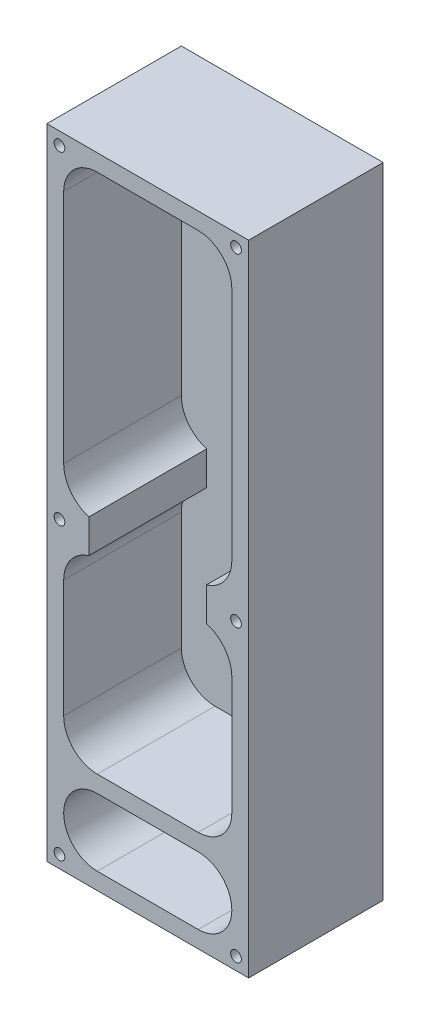
ISO-10303-21;
HEADER;
FILE_DESCRIPTION(('STEP AP214'),'2;1');
FILE_NAME('part.step','',(''),(''),'','','');
FILE_SCHEMA(('AUTOMOTIVE_DESIGN { 1 0 10303 214 1 1 1 1 }'));
ENDSEC;
DATA;
#1=APPLICATION_CONTEXT('core data for automotive mechanical design processes');
#2=APPLICATION_PROTOCOL_DEFINITION('international standard','automotive_design',2000,#1);
#3=PRODUCT_CONTEXT('',#1,'mechanical');
#4=PRODUCT('Part','Part','',(#3));
#5=PRODUCT_RELATED_PRODUCT_CATEGORY('part','',(#4));
#6=PRODUCT_DEFINITION_FORMATION('','',#4);
#7=PRODUCT_DEFINITION_CONTEXT('part definition',#1,'design');
#8=PRODUCT_DEFINITION('design','',#6,#7);
#9=PRODUCT_DEFINITION_SHAPE('','',#8);
#10=(LENGTH_UNIT() NAMED_UNIT(*) SI_UNIT(.MILLI.,.METRE.));
#11=(NAMED_UNIT(*) PLANE_ANGLE_UNIT() SI_UNIT($,.RADIAN.));
#12=(NAMED_UNIT(*) SI_UNIT($,.STERADIAN.) SOLID_ANGLE_UNIT());
#13=UNCERTAINTY_MEASURE_WITH_UNIT(LENGTH_MEASURE(1.E-05),#10,'distance_accuracy_value','');
#14=(GEOMETRIC_REPRESENTATION_CONTEXT(3) GLOBAL_UNCERTAINTY_ASSIGNED_CONTEXT((#13)) GLOBAL_UNIT_ASSIGNED_CONTEXT((#10,
#11,#12)) REPRESENTATION_CONTEXT('',''));
#15=CARTESIAN_POINT('',(0.,0.,0.));
#16=DIRECTION('',(0.,0.,1.));
#17=DIRECTION('',(1.,0.,0.));
#18=AXIS2_PLACEMENT_3D('',#15,#16,#17);
#19=CARTESIAN_POINT('',(6.35,-6.35,44.45));
#20=DIRECTION('',(1.,0.,0.));
#21=DIRECTION('',(0.,1.,0.));
#22=AXIS2_PLACEMENT_3D('',#19,#20,#21);
#23=PLANE('',#22);
#24=DIRECTION('',(0.,-1.,0.));
#25=VECTOR('',#24,1.);
#26=CARTESIAN_POINT('',(6.35,-6.35,44.45));
#27=LINE('',#26,#25);
#28=CARTESIAN_POINT('',(6.34999999999997,-146.05,44.45));
#29=VERTEX_POINT('',#28);
#30=CARTESIAN_POINT('',(6.35000000000002,-190.5,44.45));
#31=VERTEX_POINT('',#30);
#32=EDGE_CURVE('E404',#29,#31,#27,.T.);
#33=ORIENTED_EDGE('',*,*,#32,.T.);
#34=DIRECTION('',(0.,0.,1.));
#35=VECTOR('',#34,1.);
#36=CARTESIAN_POINT('',(6.35000000000002,-190.5,-70.9951582856183));
#37=LINE('',#36,#35);
#38=CARTESIAN_POINT('',(6.35000000000002,-190.5,0.));
#39=VERTEX_POINT('',#38);
#40=EDGE_CURVE('E248',#39,#31,#37,.T.);
#41=ORIENTED_EDGE('',*,*,#40,.F.);
#42=DIRECTION('',(0.,-1.,0.));
#43=VECTOR('',#42,1.);
#44=CARTESIAN_POINT('',(6.35,-6.35,0.));
#45=LINE('',#44,#43);
#46=CARTESIAN_POINT('',(6.35000000000002,-146.05,0.));
#47=VERTEX_POINT('',#46);
#48=EDGE_CURVE('E399',#47,#39,#45,.T.);
#49=ORIENTED_EDGE('',*,*,#48,.F.);
#50=DIRECTION('',(0.,0.,1.));
#51=VECTOR('',#50,1.);
#52=CARTESIAN_POINT('',(6.34999999999997,-146.05,-39.2725810840082));
#53=LINE('',#52,#51);
#54=EDGE_CURVE('E335',#47,#29,#53,.T.);
#55=ORIENTED_EDGE('',*,*,#54,.T.);
#56=EDGE_LOOP('',(#33,#41,#49,#55));
#57=FACE_BOUND('',#56,.T.);
#58=ADVANCED_FACE('F43',(#57),#23,.T.);
#59=CARTESIAN_POINT('',(0.,0.,0.));
#60=DIRECTION('',(0.,0.,1.));
#61=DIRECTION('',(1.,0.,0.));
#62=AXIS2_PLACEMENT_3D('',#59,#60,#61);
#63=PLANE('',#62);
#64=CARTESIAN_POINT('',(19.05,-190.5,0.));
#65=DIRECTION('',(0.,0.,1.));
#66=DIRECTION('',(1.,0.,0.));
#67=AXIS2_PLACEMENT_3D('',#64,#65,#66);
#68=CIRCLE('',#67,12.7);
#69=CARTESIAN_POINT('',(19.05,-203.2,0.));
#70=VERTEX_POINT('',#69);
#71=EDGE_CURVE('E59',#39,#70,#68,.T.);
#72=ORIENTED_EDGE('',*,*,#71,.T.);
#73=DIRECTION('',(1.,0.,0.));
#74=VECTOR('',#73,1.);
#75=CARTESIAN_POINT('',(19.05,-203.2,0.));
#76=LINE('',#75,#74);
#77=CARTESIAN_POINT('',(57.15,-203.2,0.));
#78=VERTEX_POINT('',#77);
#79=EDGE_CURVE('E63',#70,#78,#76,.T.);
#80=ORIENTED_EDGE('',*,*,#79,.T.);
#81=CARTESIAN_POINT('',(57.15,-190.5,0.));
#82=DIRECTION('',(0.,0.,1.));
#83=DIRECTION('',(1.,0.,0.));
#84=AXIS2_PLACEMENT_3D('',#81,#82,#83);
#85=CIRCLE('',#84,12.7);
#86=CARTESIAN_POINT('',(69.85,-190.5,0.));
#87=VERTEX_POINT('',#86);
#88=EDGE_CURVE('E252',#78,#87,#85,.T.);
#89=ORIENTED_EDGE('',*,*,#88,.T.);
#90=DIRECTION('',(0.,1.,0.));
#91=VECTOR('',#90,1.);
#92=CARTESIAN_POINT('',(69.85,-6.35,0.));
#93=LINE('',#92,#91);
#94=CARTESIAN_POINT('',(69.85,-146.05,0.));
#95=VERTEX_POINT('',#94);
#96=EDGE_CURVE('E425',#87,#95,#93,.T.);
#97=ORIENTED_EDGE('',*,*,#96,.T.);
#98=CARTESIAN_POINT('',(56.6208333333334,-146.05,0.));
#99=DIRECTION('',(0.,0.,1.));
#100=DIRECTION('',(1.,0.,0.));
#101=AXIS2_PLACEMENT_3D('',#98,#99,#100);
#102=CIRCLE('',#101,13.2291666666667);
#103=CARTESIAN_POINT('',(60.325,-133.35,0.));
#104=VERTEX_POINT('',#103);
#105=EDGE_CURVE('E357',#95,#104,#102,.T.);
#106=ORIENTED_EDGE('',*,*,#105,.T.);
#107=DIRECTION('',(0.,1.,0.));
#108=VECTOR('',#107,1.);
#109=CARTESIAN_POINT('',(60.325,-120.65,0.));
#110=LINE('',#109,#108);
#111=CARTESIAN_POINT('',(60.325,-120.65,0.));
#112=VERTEX_POINT('',#111);
#113=EDGE_CURVE('E353',#104,#112,#110,.T.);
#114=ORIENTED_EDGE('',*,*,#113,.T.);
#115=CARTESIAN_POINT('',(56.6208333333334,-107.95,0.));
#116=DIRECTION('',(0.,0.,1.));
#117=DIRECTION('',(1.,0.,0.));
#118=AXIS2_PLACEMENT_3D('',#115,#116,#117);
#119=CIRCLE('',#118,13.2291666666667);
#120=CARTESIAN_POINT('',(69.85,-107.95,0.));
#121=VERTEX_POINT('',#120);
#122=EDGE_CURVE('E350',#112,#121,#119,.T.);
#123=ORIENTED_EDGE('',*,*,#122,.T.);
#124=CARTESIAN_POINT('',(69.85,-19.05,0.));
#125=VERTEX_POINT('',#124);
#126=EDGE_CURVE('E424',#121,#125,#93,.T.);
#127=ORIENTED_EDGE('',*,*,#126,.T.);
#128=CARTESIAN_POINT('',(57.15,-19.05,0.));
#129=DIRECTION('',(0.,0.,1.));
#130=DIRECTION('',(1.,0.,0.));
#131=AXIS2_PLACEMENT_3D('',#128,#129,#130);
#132=CIRCLE('',#131,12.7);
#133=CARTESIAN_POINT('',(57.15,-6.35,0.));
#134=VERTEX_POINT('',#133);
#135=EDGE_CURVE('E484',#125,#134,#132,.T.);
#136=ORIENTED_EDGE('',*,*,#135,.T.);
#137=DIRECTION('',(-1.,0.,0.));
#138=VECTOR('',#137,1.);
#139=CARTESIAN_POINT('',(6.35,-6.35,0.));
#140=LINE('',#139,#138);
#141=CARTESIAN_POINT('',(19.05,-6.35,0.));
#142=VERTEX_POINT('',#141);
#143=EDGE_CURVE('E428',#134,#142,#140,.T.);
#144=ORIENTED_EDGE('',*,*,#143,.T.);
#145=CARTESIAN_POINT('',(19.05,-19.05,0.));
#146=DIRECTION('',(0.,0.,1.));
#147=DIRECTION('',(1.,0.,0.));
#148=AXIS2_PLACEMENT_3D('',#145,#146,#147);
#149=CIRCLE('',#148,12.7);
#150=CARTESIAN_POINT('',(6.35,-19.05,0.));
#151=VERTEX_POINT('',#150);
#152=EDGE_CURVE('E52',#142,#151,#149,.T.);
#153=ORIENTED_EDGE('',*,*,#152,.T.);
#154=CARTESIAN_POINT('',(6.34999999999998,-107.95,0.));
#155=VERTEX_POINT('',#154);
#156=EDGE_CURVE('E416',#151,#155,#45,.T.);
#157=ORIENTED_EDGE('',*,*,#156,.T.);
#158=CARTESIAN_POINT('',(19.5791666666666,-107.95,0.));
#159=DIRECTION('',(0.,0.,1.));
#160=DIRECTION('',(1.,0.,0.));
#161=AXIS2_PLACEMENT_3D('',#158,#159,#160);
#162=CIRCLE('',#161,13.2291666666667);
#163=CARTESIAN_POINT('',(15.875,-120.65,0.));
#164=VERTEX_POINT('',#163);
#165=EDGE_CURVE('E316',#164,#155,#162,.F.);
#166=ORIENTED_EDGE('',*,*,#165,.F.);
#167=DIRECTION('',(0.,1.,0.));
#168=VECTOR('',#167,1.);
#169=CARTESIAN_POINT('',(15.875,-120.65,0.));
#170=LINE('',#169,#168);
#171=CARTESIAN_POINT('',(15.875,-133.35,0.));
#172=VERTEX_POINT('',#171);
#173=EDGE_CURVE('E320',#172,#164,#170,.T.);
#174=ORIENTED_EDGE('',*,*,#173,.F.);
#175=CARTESIAN_POINT('',(19.5791666666666,-146.05,0.));
#176=DIRECTION('',(0.,0.,1.));
#177=DIRECTION('',(1.,0.,0.));
#178=AXIS2_PLACEMENT_3D('',#175,#176,#177);
#179=CIRCLE('',#178,13.2291666666667);
#180=EDGE_CURVE('E319',#47,#172,#179,.F.);
#181=ORIENTED_EDGE('',*,*,#180,.F.);
#182=ORIENTED_EDGE('',*,*,#48,.T.);
#183=EDGE_LOOP('',(#72,#80,#89,#97,#106,#114,#123,#127,#136,#144,#153,#157,#166,#174,#181,#182));
#184=FACE_BOUND('',#183,.T.);
#185=ADVANCED_FACE('F493',(#184),#63,.T.);
#186=DIRECTION('',(-1.,0.,0.));
#187=VECTOR('',#186,1.);
#188=CARTESIAN_POINT('',(19.05,-209.55,0.));
#189=LINE('',#188,#187);
#190=CARTESIAN_POINT('',(57.15,-209.55,0.));
#191=VERTEX_POINT('',#190);
#192=CARTESIAN_POINT('',(19.05,-209.55,0.));
#193=VERTEX_POINT('',#192);
#194=EDGE_CURVE('E264',#191,#193,#189,.T.);
#195=ORIENTED_EDGE('',*,*,#194,.T.);
#196=CARTESIAN_POINT('',(19.05,-222.25,0.));
#197=DIRECTION('',(0.,0.,1.));
#198=DIRECTION('',(1.,0.,0.));
#199=AXIS2_PLACEMENT_3D('',#196,#197,#198);
#200=CIRCLE('',#199,12.7);
#201=CARTESIAN_POINT('',(19.05,-234.95,0.));
#202=VERTEX_POINT('',#201);
#203=EDGE_CURVE('E216',#193,#202,#200,.T.);
#204=ORIENTED_EDGE('',*,*,#203,.T.);
#205=DIRECTION('',(1.,0.,0.));
#206=VECTOR('',#205,1.);
#207=CARTESIAN_POINT('',(6.35000000000003,-234.95,0.));
#208=LINE('',#207,#206);
#209=CARTESIAN_POINT('',(57.15,-234.95,0.));
#210=VERTEX_POINT('',#209);
#211=EDGE_CURVE('E420',#202,#210,#208,.T.);
#212=ORIENTED_EDGE('',*,*,#211,.T.);
#213=CARTESIAN_POINT('',(57.15,-222.25,0.));
#214=DIRECTION('',(0.,0.,1.));
#215=DIRECTION('',(1.,0.,0.));
#216=AXIS2_PLACEMENT_3D('',#213,#214,#215);
#217=CIRCLE('',#216,12.7);
#218=EDGE_CURVE('E215',#210,#191,#217,.T.);
#219=ORIENTED_EDGE('',*,*,#218,.T.);
#220=EDGE_LOOP('',(#195,#204,#212,#219));
#221=FACE_BOUND('',#220,.T.);
#222=ADVANCED_FACE('F567',(#221),#63,.T.);
#223=CARTESIAN_POINT('',(69.85,-6.35,44.45));
#224=DIRECTION('',(-1.,0.,0.));
#225=DIRECTION('',(0.,-1.,0.));
#226=AXIS2_PLACEMENT_3D('',#223,#224,#225);
#227=PLANE('',#226);
#228=DIRECTION('',(0.,0.,1.));
#229=VECTOR('',#228,1.);
#230=CARTESIAN_POINT('',(69.85,-190.5,-70.9951582856183));
#231=LINE('',#230,#229);
#232=CARTESIAN_POINT('',(69.85,-190.5,44.45));
#233=VERTEX_POINT('',#232);
#234=EDGE_CURVE('E259',#87,#233,#231,.T.);
#235=ORIENTED_EDGE('',*,*,#234,.T.);
#236=DIRECTION('',(0.,1.,0.));
#237=VECTOR('',#236,1.);
#238=CARTESIAN_POINT('',(69.85,-6.35,44.45));
#239=LINE('',#238,#237);
#240=CARTESIAN_POINT('',(69.85,-146.05,44.45));
#241=VERTEX_POINT('',#240);
#242=EDGE_CURVE('E408',#233,#241,#239,.T.);
#243=ORIENTED_EDGE('',*,*,#242,.T.);
#244=DIRECTION('',(0.,0.,1.));
#245=VECTOR('',#244,1.);
#246=CARTESIAN_POINT('',(69.85,-146.05,-39.2725810840082));
#247=LINE('',#246,#245);
#248=EDGE_CURVE('E372',#95,#241,#247,.T.);
#249=ORIENTED_EDGE('',*,*,#248,.F.);
#250=ORIENTED_EDGE('',*,*,#96,.F.);
#251=EDGE_LOOP('',(#235,#243,#249,#250));
#252=FACE_BOUND('',#251,.T.);
#253=ADVANCED_FACE('F530',(#252),#227,.T.);
#254=CARTESIAN_POINT('',(0.,0.,44.45));
#255=DIRECTION('',(0.,0.,1.));
#256=DIRECTION('',(1.,0.,0.));
#257=AXIS2_PLACEMENT_3D('',#254,#255,#256);
#258=PLANE('',#257);
#259=CARTESIAN_POINT('',(19.05,-222.25,44.45));
#260=DIRECTION('',(0.,0.,1.));
#261=DIRECTION('',(1.,0.,0.));
#262=AXIS2_PLACEMENT_3D('',#259,#260,#261);
#263=CIRCLE('',#262,12.7);
#264=CARTESIAN_POINT('',(19.05,-234.95,44.45));
#265=VERTEX_POINT('',#264);
#266=CARTESIAN_POINT('',(19.05,-209.55,44.45));
#267=VERTEX_POINT('',#266);
#268=EDGE_CURVE('E204',#265,#267,#263,.F.);
#269=ORIENTED_EDGE('',*,*,#268,.T.);
#270=DIRECTION('',(1.,0.,0.));
#271=VECTOR('',#270,1.);
#272=CARTESIAN_POINT('',(19.05,-209.55,44.45));
#273=LINE('',#272,#271);
#274=CARTESIAN_POINT('',(57.15,-209.55,44.45));
#275=VERTEX_POINT('',#274);
#276=EDGE_CURVE('E209',#267,#275,#273,.T.);
#277=ORIENTED_EDGE('',*,*,#276,.T.);
#278=CARTESIAN_POINT('',(57.15,-222.25,44.45));
#279=DIRECTION('',(0.,0.,1.));
#280=DIRECTION('',(1.,0.,0.));
#281=AXIS2_PLACEMENT_3D('',#278,#279,#280);
#282=CIRCLE('',#281,12.7);
#283=CARTESIAN_POINT('',(57.15,-234.95,44.45));
#284=VERTEX_POINT('',#283);
#285=EDGE_CURVE('E481',#275,#284,#282,.F.);
#286=ORIENTED_EDGE('',*,*,#285,.T.);
#287=DIRECTION('',(1.,0.,0.));
#288=VECTOR('',#287,1.);
#289=CARTESIAN_POINT('',(6.35000000000003,-234.95,44.45));
#290=LINE('',#289,#288);
#291=EDGE_CURVE('E211',#265,#284,#290,.T.);
#292=ORIENTED_EDGE('',*,*,#291,.F.);
#293=EDGE_LOOP('',(#269,#277,#286,#292));
#294=FACE_BOUND('',#293,.T.);
#295=CARTESIAN_POINT('',(4.7625,-4.76250000000001,44.45));
#296=DIRECTION('',(0.,0.,1.));
#297=DIRECTION('',(1.,0.,0.));
#298=AXIS2_PLACEMENT_3D('',#295,#296,#297);
#299=CIRCLE('',#298,2.01929999999999);
#300=CARTESIAN_POINT('',(6.7818,-4.76250000000001,44.45));
#301=VERTEX_POINT('',#300);
#302=EDGE_CURVE('E267',#301,#301,#299,.T.);
#303=ORIENTED_EDGE('',*,*,#302,.F.);
#304=EDGE_LOOP('',(#303));
#305=FACE_BOUND('',#304,.T.);
#306=CARTESIAN_POINT('',(71.4375,-4.7625,44.45));
#307=DIRECTION('',(0.,0.,1.));
#308=DIRECTION('',(1.,0.,0.));
#309=AXIS2_PLACEMENT_3D('',#306,#307,#308);
#310=CIRCLE('',#309,2.01929999999999);
#311=CARTESIAN_POINT('',(73.4568,-4.7625,44.45));
#312=VERTEX_POINT('',#311);
#313=EDGE_CURVE('E275',#312,#312,#310,.T.);
#314=ORIENTED_EDGE('',*,*,#313,.F.);
#315=EDGE_LOOP('',(#314));
#316=FACE_BOUND('',#315,.T.);
#317=CARTESIAN_POINT('',(71.4375,-127.,44.45));
#318=DIRECTION('',(0.,0.,1.));
#319=DIRECTION('',(1.,0.,0.));
#320=AXIS2_PLACEMENT_3D('',#317,#318,#319);
#321=CIRCLE('',#320,2.01929999999999);
#322=CARTESIAN_POINT('',(73.4568,-127.,44.45));
#323=VERTEX_POINT('',#322);
#324=EDGE_CURVE('E283',#323,#323,#321,.T.);
#325=ORIENTED_EDGE('',*,*,#324,.F.);
#326=EDGE_LOOP('',(#325));
#327=FACE_BOUND('',#326,.T.);
#328=CARTESIAN_POINT('',(4.76250000000002,-127.,44.45));
#329=DIRECTION('',(0.,0.,1.));
#330=DIRECTION('',(1.,0.,0.));
#331=AXIS2_PLACEMENT_3D('',#328,#329,#330);
#332=CIRCLE('',#331,2.01929999999999);
#333=CARTESIAN_POINT('',(6.78180000000001,-127.,44.45));
#334=VERTEX_POINT('',#333);
#335=EDGE_CURVE('E291',#334,#334,#332,.T.);
#336=ORIENTED_EDGE('',*,*,#335,.F.);
#337=EDGE_LOOP('',(#336));
#338=FACE_BOUND('',#337,.T.);
#339=CARTESIAN_POINT('',(4.76250000000003,-236.5375,44.45));
#340=DIRECTION('',(0.,0.,1.));
#341=DIRECTION('',(1.,0.,0.));
#342=AXIS2_PLACEMENT_3D('',#339,#340,#341);
#343=CIRCLE('',#342,2.01929999999999);
#344=CARTESIAN_POINT('',(6.78180000000002,-236.5375,44.45));
#345=VERTEX_POINT('',#344);
#346=EDGE_CURVE('E299',#345,#345,#343,.T.);
#347=ORIENTED_EDGE('',*,*,#346,.F.);
#348=EDGE_LOOP('',(#347));
#349=FACE_BOUND('',#348,.T.);
#350=CARTESIAN_POINT('',(71.4375,-236.5375,44.45));
#351=DIRECTION('',(0.,0.,1.));
#352=DIRECTION('',(1.,0.,0.));
#353=AXIS2_PLACEMENT_3D('',#350,#351,#352);
#354=CIRCLE('',#353,2.01929999999999);
#355=CARTESIAN_POINT('',(73.4568,-236.5375,44.45));
#356=VERTEX_POINT('',#355);
#357=EDGE_CURVE('E307',#356,#356,#354,.T.);
#358=ORIENTED_EDGE('',*,*,#357,.F.);
#359=EDGE_LOOP('',(#358));
#360=FACE_BOUND('',#359,.T.);
#361=DIRECTION('',(0.,-1.,0.));
#362=VECTOR('',#361,1.);
#363=CARTESIAN_POINT('',(0.,0.,44.45));
#364=LINE('',#363,#362);
#365=CARTESIAN_POINT('',(0.,0.,44.45));
#366=VERTEX_POINT('',#365);
#367=CARTESIAN_POINT('',(0.,-241.3,44.45));
#368=VERTEX_POINT('',#367);
#369=EDGE_CURVE('E415',#366,#368,#364,.T.);
#370=ORIENTED_EDGE('',*,*,#369,.T.);
#371=DIRECTION('',(1.,0.,0.));
#372=VECTOR('',#371,1.);
#373=CARTESIAN_POINT('',(0.,-241.3,44.45));
#374=LINE('',#373,#372);
#375=CARTESIAN_POINT('',(76.2,-241.3,44.45));
#376=VERTEX_POINT('',#375);
#377=EDGE_CURVE('E435',#368,#376,#374,.T.);
#378=ORIENTED_EDGE('',*,*,#377,.T.);
#379=DIRECTION('',(0.,1.,0.));
#380=VECTOR('',#379,1.);
#381=CARTESIAN_POINT('',(76.2,0.,44.45));
#382=LINE('',#381,#380);
#383=CARTESIAN_POINT('',(76.2,0.,44.45));
#384=VERTEX_POINT('',#383);
#385=EDGE_CURVE('E438',#376,#384,#382,.T.);
#386=ORIENTED_EDGE('',*,*,#385,.T.);
#387=DIRECTION('',(-1.,0.,0.));
#388=VECTOR('',#387,1.);
#389=CARTESIAN_POINT('',(0.,0.,44.45));
#390=LINE('',#389,#388);
#391=EDGE_CURVE('E441',#384,#366,#390,.T.);
#392=ORIENTED_EDGE('',*,*,#391,.T.);
#393=EDGE_LOOP('',(#370,#378,#386,#392));
#394=FACE_BOUND('',#393,.T.);
#395=CARTESIAN_POINT('',(19.05,-190.5,44.45));
#396=DIRECTION('',(0.,0.,-1.));
#397=DIRECTION('',(1.,0.,0.));
#398=AXIS2_PLACEMENT_3D('',#395,#396,#397);
#399=CIRCLE('',#398,12.7);
#400=CARTESIAN_POINT('',(19.05,-203.2,44.45));
#401=VERTEX_POINT('',#400);
#402=EDGE_CURVE('E227',#401,#31,#399,.T.);
#403=ORIENTED_EDGE('',*,*,#402,.T.);
#404=ORIENTED_EDGE('',*,*,#32,.F.);
#405=CARTESIAN_POINT('',(19.5791666666666,-146.05,44.45));
#406=DIRECTION('',(0.,0.,1.));
#407=DIRECTION('',(-1.,0.,0.));
#408=AXIS2_PLACEMENT_3D('',#405,#406,#407);
#409=CIRCLE('',#408,13.2291666666667);
#410=CARTESIAN_POINT('',(15.875,-133.35,44.45));
#411=VERTEX_POINT('',#410);
#412=EDGE_CURVE('E315',#411,#29,#409,.T.);
#413=ORIENTED_EDGE('',*,*,#412,.F.);
#414=DIRECTION('',(0.,-1.,0.));
#415=VECTOR('',#414,1.);
#416=CARTESIAN_POINT('',(15.875,-120.65,44.45));
#417=LINE('',#416,#415);
#418=CARTESIAN_POINT('',(15.875,-120.65,44.45));
#419=VERTEX_POINT('',#418);
#420=EDGE_CURVE('E326',#419,#411,#417,.T.);
#421=ORIENTED_EDGE('',*,*,#420,.F.);
#422=CARTESIAN_POINT('',(19.5791666666666,-107.95,44.45));
#423=DIRECTION('',(0.,0.,1.));
#424=DIRECTION('',(1.,0.,0.));
#425=AXIS2_PLACEMENT_3D('',#422,#423,#424);
#426=CIRCLE('',#425,13.2291666666667);
#427=CARTESIAN_POINT('',(6.34999999999998,-107.95,44.45));
#428=VERTEX_POINT('',#427);
#429=EDGE_CURVE('E330',#428,#419,#426,.T.);
#430=ORIENTED_EDGE('',*,*,#429,.F.);
#431=CARTESIAN_POINT('',(6.35,-19.05,44.45));
#432=VERTEX_POINT('',#431);
#433=EDGE_CURVE('E400',#432,#428,#27,.T.);
#434=ORIENTED_EDGE('',*,*,#433,.F.);
#435=CARTESIAN_POINT('',(19.05,-19.05,44.45));
#436=DIRECTION('',(0.,0.,1.));
#437=DIRECTION('',(1.,0.,0.));
#438=AXIS2_PLACEMENT_3D('',#435,#436,#437);
#439=CIRCLE('',#438,12.7);
#440=CARTESIAN_POINT('',(19.05,-6.35,44.45));
#441=VERTEX_POINT('',#440);
#442=EDGE_CURVE('E11',#432,#441,#439,.F.);
#443=ORIENTED_EDGE('',*,*,#442,.T.);
#444=DIRECTION('',(-1.,0.,0.));
#445=VECTOR('',#444,1.);
#446=CARTESIAN_POINT('',(6.35,-6.35,44.45));
#447=LINE('',#446,#445);
#448=CARTESIAN_POINT('',(57.15,-6.35,44.45));
#449=VERTEX_POINT('',#448);
#450=EDGE_CURVE('E411',#449,#441,#447,.T.);
#451=ORIENTED_EDGE('',*,*,#450,.F.);
#452=CARTESIAN_POINT('',(57.15,-19.05,44.45));
#453=DIRECTION('',(0.,0.,1.));
#454=DIRECTION('',(1.,0.,0.));
#455=AXIS2_PLACEMENT_3D('',#452,#453,#454);
#456=CIRCLE('',#455,12.7);
#457=CARTESIAN_POINT('',(69.85,-19.05,44.45));
#458=VERTEX_POINT('',#457);
#459=EDGE_CURVE('E488',#449,#458,#456,.F.);
#460=ORIENTED_EDGE('',*,*,#459,.T.);
#461=CARTESIAN_POINT('',(69.85,-107.95,44.45));
#462=VERTEX_POINT('',#461);
#463=EDGE_CURVE('E407',#462,#458,#239,.T.);
#464=ORIENTED_EDGE('',*,*,#463,.F.);
#465=CARTESIAN_POINT('',(56.6208333333334,-107.95,44.45));
#466=DIRECTION('',(0.,0.,-1.));
#467=DIRECTION('',(-1.,0.,0.));
#468=AXIS2_PLACEMENT_3D('',#465,#466,#467);
#469=CIRCLE('',#468,13.2291666666667);
#470=CARTESIAN_POINT('',(60.325,-120.65,44.45));
#471=VERTEX_POINT('',#470);
#472=EDGE_CURVE('E364',#462,#471,#469,.T.);
#473=ORIENTED_EDGE('',*,*,#472,.T.);
#474=DIRECTION('',(0.,-1.,0.));
#475=VECTOR('',#474,1.);
#476=CARTESIAN_POINT('',(60.325,-120.65,44.45));
#477=LINE('',#476,#475);
#478=CARTESIAN_POINT('',(60.325,-133.35,44.45));
#479=VERTEX_POINT('',#478);
#480=EDGE_CURVE('E368',#471,#479,#477,.T.);
#481=ORIENTED_EDGE('',*,*,#480,.T.);
#482=CARTESIAN_POINT('',(56.6208333333334,-146.05,44.45));
#483=DIRECTION('',(0.,0.,-1.));
#484=DIRECTION('',(1.,0.,0.));
#485=AXIS2_PLACEMENT_3D('',#482,#483,#484);
#486=CIRCLE('',#485,13.2291666666667);
#487=EDGE_CURVE('E323',#479,#241,#486,.T.);
#488=ORIENTED_EDGE('',*,*,#487,.T.);
#489=ORIENTED_EDGE('',*,*,#242,.F.);
#490=CARTESIAN_POINT('',(57.15,-190.5,44.45));
#491=DIRECTION('',(0.,0.,-1.));
#492=DIRECTION('',(-1.,0.,0.));
#493=AXIS2_PLACEMENT_3D('',#490,#491,#492);
#494=CIRCLE('',#493,12.7);
#495=CARTESIAN_POINT('',(57.15,-203.2,44.45));
#496=VERTEX_POINT('',#495);
#497=EDGE_CURVE('E233',#233,#496,#494,.T.);
#498=ORIENTED_EDGE('',*,*,#497,.T.);
#499=DIRECTION('',(-1.,0.,0.));
#500=VECTOR('',#499,1.);
#501=CARTESIAN_POINT('',(19.05,-203.2,44.45));
#502=LINE('',#501,#500);
#503=EDGE_CURVE('E237',#496,#401,#502,.T.);
#504=ORIENTED_EDGE('',*,*,#503,.T.);
#505=EDGE_LOOP('',(#403,#404,#413,#421,#430,#434,#443,#451,#460,#464,#473,#481,#488,#489,#498,#504));
#506=FACE_BOUND('',#505,.T.);
#507=ADVANCED_FACE('F206',(#294,#305,#316,#327,#338,#349,#360,#394,#506),#258,.T.);
#508=CARTESIAN_POINT('',(0.,0.,44.45));
#509=DIRECTION('',(1.,0.,0.));
#510=DIRECTION('',(0.,0.,-1.));
#511=AXIS2_PLACEMENT_3D('',#508,#509,#510);
#512=PLANE('',#511);
#513=DIRECTION('',(0.,0.,-1.));
#514=VECTOR('',#513,1.);
#515=CARTESIAN_POINT('',(0.,0.,44.45));
#516=LINE('',#515,#514);
#517=CARTESIAN_POINT('',(0.,0.,-6.35));
#518=VERTEX_POINT('',#517);
#519=EDGE_CURVE('E444',#366,#518,#516,.T.);
#520=ORIENTED_EDGE('',*,*,#519,.T.);
#521=DIRECTION('',(0.,1.,0.));
#522=VECTOR('',#521,1.);
#523=CARTESIAN_POINT('',(0.,0.,-6.35));
#524=LINE('',#523,#522);
#525=CARTESIAN_POINT('',(0.,-241.3,-6.35));
#526=VERTEX_POINT('',#525);
#527=EDGE_CURVE('E360',#526,#518,#524,.T.);
#528=ORIENTED_EDGE('',*,*,#527,.F.);
#529=DIRECTION('',(0.,0.,-1.));
#530=VECTOR('',#529,1.);
#531=CARTESIAN_POINT('',(0.,-241.3,44.45));
#532=LINE('',#531,#530);
#533=EDGE_CURVE('E453',#368,#526,#532,.T.);
#534=ORIENTED_EDGE('',*,*,#533,.F.);
#535=ORIENTED_EDGE('',*,*,#369,.F.);
#536=EDGE_LOOP('',(#520,#528,#534,#535));
#537=FACE_BOUND('',#536,.T.);
#538=ADVANCED_FACE('F720',(#537),#512,.F.);
#539=CARTESIAN_POINT('',(0.,-241.3,44.45));
#540=DIRECTION('',(0.,1.,0.));
#541=DIRECTION('',(0.,0.,1.));
#542=AXIS2_PLACEMENT_3D('',#539,#540,#541);
#543=PLANE('',#542);
#544=ORIENTED_EDGE('',*,*,#533,.T.);
#545=DIRECTION('',(-1.,0.,0.));
#546=VECTOR('',#545,1.);
#547=CARTESIAN_POINT('',(0.,-241.3,-6.35));
#548=LINE('',#547,#546);
#549=CARTESIAN_POINT('',(76.2,-241.3,-6.35));
#550=VERTEX_POINT('',#549);
#551=EDGE_CURVE('E395',#550,#526,#548,.T.);
#552=ORIENTED_EDGE('',*,*,#551,.F.);
#553=DIRECTION('',(0.,0.,-1.));
#554=VECTOR('',#553,1.);
#555=CARTESIAN_POINT('',(76.2,-241.3,44.45));
#556=LINE('',#555,#554);
#557=EDGE_CURVE('E450',#376,#550,#556,.T.);
#558=ORIENTED_EDGE('',*,*,#557,.F.);
#559=ORIENTED_EDGE('',*,*,#377,.F.);
#560=EDGE_LOOP('',(#544,#552,#558,#559));
#561=FACE_BOUND('',#560,.T.);
#562=ADVANCED_FACE('F856',(#561),#543,.F.);
#563=CARTESIAN_POINT('',(76.2,0.,44.45));
#564=DIRECTION('',(-1.,0.,0.));
#565=DIRECTION('',(0.,-1.,0.));
#566=AXIS2_PLACEMENT_3D('',#563,#564,#565);
#567=PLANE('',#566);
#568=ORIENTED_EDGE('',*,*,#557,.T.);
#569=DIRECTION('',(0.,-1.,0.));
#570=VECTOR('',#569,1.);
#571=CARTESIAN_POINT('',(76.2,0.,-6.35));
#572=LINE('',#571,#570);
#573=CARTESIAN_POINT('',(76.2,0.,-6.35));
#574=VERTEX_POINT('',#573);
#575=EDGE_CURVE('E391',#574,#550,#572,.T.);
#576=ORIENTED_EDGE('',*,*,#575,.F.);
#577=DIRECTION('',(0.,0.,-1.));
#578=VECTOR('',#577,1.);
#579=CARTESIAN_POINT('',(76.2,0.,44.45));
#580=LINE('',#579,#578);
#581=EDGE_CURVE('E447',#384,#574,#580,.T.);
#582=ORIENTED_EDGE('',*,*,#581,.F.);
#583=ORIENTED_EDGE('',*,*,#385,.F.);
#584=EDGE_LOOP('',(#568,#576,#582,#583));
#585=FACE_BOUND('',#584,.T.);
#586=ADVANCED_FACE('F580',(#585),#567,.F.);
#587=CARTESIAN_POINT('',(0.,0.,44.45));
#588=DIRECTION('',(0.,-1.,0.));
#589=DIRECTION('',(0.,0.,-1.));
#590=AXIS2_PLACEMENT_3D('',#587,#588,#589);
#591=PLANE('',#590);
#592=ORIENTED_EDGE('',*,*,#581,.T.);
#593=DIRECTION('',(1.,0.,0.));
#594=VECTOR('',#593,1.);
#595=CARTESIAN_POINT('',(0.,0.,-6.35));
#596=LINE('',#595,#594);
#597=EDGE_CURVE('E387',#518,#574,#596,.T.);
#598=ORIENTED_EDGE('',*,*,#597,.F.);
#599=ORIENTED_EDGE('',*,*,#519,.F.);
#600=ORIENTED_EDGE('',*,*,#391,.F.);
#601=EDGE_LOOP('',(#592,#598,#599,#600));
#602=FACE_BOUND('',#601,.T.);
#603=ADVANCED_FACE('F573',(#602),#591,.F.);
#604=DIRECTION('',(0.,0.,1.));
#605=VECTOR('',#604,1.);
#606=CARTESIAN_POINT('',(6.34999999999998,-107.95,-39.2725810840082));
#607=LINE('',#606,#605);
#608=EDGE_CURVE('E339',#155,#428,#607,.T.);
#609=ORIENTED_EDGE('',*,*,#608,.F.);
#610=ORIENTED_EDGE('',*,*,#156,.F.);
#611=DIRECTION('',(0.,0.,-1.));
#612=VECTOR('',#611,1.);
#613=CARTESIAN_POINT('',(6.35,-19.05,44.45));
#614=LINE('',#613,#612);
#615=EDGE_CURVE('E456',#151,#432,#614,.F.);
#616=ORIENTED_EDGE('',*,*,#615,.T.);
#617=ORIENTED_EDGE('',*,*,#433,.T.);
#618=EDGE_LOOP('',(#609,#610,#616,#617));
#619=FACE_BOUND('',#618,.T.);
#620=ADVANCED_FACE('F563',(#619),#23,.T.);
#621=CARTESIAN_POINT('',(6.35000000000003,-234.95,44.45));
#622=DIRECTION('',(0.,1.,0.));
#623=DIRECTION('',(0.,0.,1.));
#624=AXIS2_PLACEMENT_3D('',#621,#622,#623);
#625=PLANE('',#624);
#626=ORIENTED_EDGE('',*,*,#211,.F.);
#627=DIRECTION('',(0.,0.,-1.));
#628=VECTOR('',#627,1.);
#629=CARTESIAN_POINT('',(19.05,-234.95,44.45));
#630=LINE('',#629,#628);
#631=EDGE_CURVE('E463',#202,#265,#630,.F.);
#632=ORIENTED_EDGE('',*,*,#631,.T.);
#633=ORIENTED_EDGE('',*,*,#291,.T.);
#634=DIRECTION('',(0.,0.,-1.));
#635=VECTOR('',#634,1.);
#636=CARTESIAN_POINT('',(57.15,-234.95,0.));
#637=LINE('',#636,#635);
#638=EDGE_CURVE('E459',#284,#210,#637,.T.);
#639=ORIENTED_EDGE('',*,*,#638,.T.);
#640=EDGE_LOOP('',(#626,#632,#633,#639));
#641=FACE_BOUND('',#640,.T.);
#642=ADVANCED_FACE('F572',(#641),#625,.T.);
#643=DIRECTION('',(0.,0.,1.));
#644=VECTOR('',#643,1.);
#645=CARTESIAN_POINT('',(69.85,-107.95,-39.2725810840082));
#646=LINE('',#645,#644);
#647=EDGE_CURVE('E378',#121,#462,#646,.T.);
#648=ORIENTED_EDGE('',*,*,#647,.T.);
#649=ORIENTED_EDGE('',*,*,#463,.T.);
#650=DIRECTION('',(0.,0.,-1.));
#651=VECTOR('',#650,1.);
#652=CARTESIAN_POINT('',(69.85,-19.05,0.));
#653=LINE('',#652,#651);
#654=EDGE_CURVE('E466',#458,#125,#653,.T.);
#655=ORIENTED_EDGE('',*,*,#654,.T.);
#656=ORIENTED_EDGE('',*,*,#126,.F.);
#657=EDGE_LOOP('',(#648,#649,#655,#656));
#658=FACE_BOUND('',#657,.T.);
#659=ADVANCED_FACE('F513',(#658),#227,.T.);
#660=CARTESIAN_POINT('',(6.35,-6.35,44.45));
#661=DIRECTION('',(0.,-1.,0.));
#662=DIRECTION('',(0.,0.,-1.));
#663=AXIS2_PLACEMENT_3D('',#660,#661,#662);
#664=PLANE('',#663);
#665=ORIENTED_EDGE('',*,*,#143,.F.);
#666=DIRECTION('',(0.,0.,-1.));
#667=VECTOR('',#666,1.);
#668=CARTESIAN_POINT('',(57.15,-6.35,44.45));
#669=LINE('',#668,#667);
#670=EDGE_CURVE('E474',#134,#449,#669,.F.);
#671=ORIENTED_EDGE('',*,*,#670,.T.);
#672=ORIENTED_EDGE('',*,*,#450,.T.);
#673=DIRECTION('',(0.,0.,-1.));
#674=VECTOR('',#673,1.);
#675=CARTESIAN_POINT('',(19.05,-6.35,0.));
#676=LINE('',#675,#674);
#677=EDGE_CURVE('E470',#441,#142,#676,.T.);
#678=ORIENTED_EDGE('',*,*,#677,.T.);
#679=EDGE_LOOP('',(#665,#671,#672,#678));
#680=FACE_BOUND('',#679,.T.);
#681=ADVANCED_FACE('F501',(#680),#664,.T.);
#682=CARTESIAN_POINT('',(19.05,-222.25,44.45));
#683=DIRECTION('',(0.,0.,1.));
#684=DIRECTION('',(1.,0.,0.));
#685=AXIS2_PLACEMENT_3D('',#682,#683,#684);
#686=CYLINDRICAL_SURFACE('',#685,12.7);
#687=ORIENTED_EDGE('',*,*,#268,.F.);
#688=ORIENTED_EDGE('',*,*,#631,.F.);
#689=ORIENTED_EDGE('',*,*,#203,.F.);
#690=DIRECTION('',(0.,0.,1.));
#691=VECTOR('',#690,1.);
#692=CARTESIAN_POINT('',(19.05,-209.55,-70.9951582856183));
#693=LINE('',#692,#691);
#694=EDGE_CURVE('E219',#193,#267,#693,.T.);
#695=ORIENTED_EDGE('',*,*,#694,.T.);
#696=EDGE_LOOP('',(#687,#688,#689,#695));
#697=FACE_BOUND('',#696,.T.);
#698=ADVANCED_FACE('F220',(#697),#686,.F.);
#699=CARTESIAN_POINT('',(57.15,-222.25,44.45));
#700=DIRECTION('',(0.,0.,1.));
#701=DIRECTION('',(1.,0.,0.));
#702=AXIS2_PLACEMENT_3D('',#699,#700,#701);
#703=CYLINDRICAL_SURFACE('',#702,12.7);
#704=ORIENTED_EDGE('',*,*,#285,.F.);
#705=DIRECTION('',(0.,0.,1.));
#706=VECTOR('',#705,1.);
#707=CARTESIAN_POINT('',(57.15,-209.55,-70.9951582856183));
#708=LINE('',#707,#706);
#709=EDGE_CURVE('E226',#191,#275,#708,.T.);
#710=ORIENTED_EDGE('',*,*,#709,.F.);
#711=ORIENTED_EDGE('',*,*,#218,.F.);
#712=ORIENTED_EDGE('',*,*,#638,.F.);
#713=EDGE_LOOP('',(#704,#710,#711,#712));
#714=FACE_BOUND('',#713,.T.);
#715=ADVANCED_FACE('F680',(#714),#703,.F.);
#716=CARTESIAN_POINT('',(57.15,-19.05,44.45));
#717=DIRECTION('',(0.,0.,1.));
#718=DIRECTION('',(1.,0.,0.));
#719=AXIS2_PLACEMENT_3D('',#716,#717,#718);
#720=CYLINDRICAL_SURFACE('',#719,12.7);
#721=ORIENTED_EDGE('',*,*,#459,.F.);
#722=ORIENTED_EDGE('',*,*,#670,.F.);
#723=ORIENTED_EDGE('',*,*,#135,.F.);
#724=ORIENTED_EDGE('',*,*,#654,.F.);
#725=EDGE_LOOP('',(#721,#722,#723,#724));
#726=FACE_BOUND('',#725,.T.);
#727=ADVANCED_FACE('F509',(#726),#720,.F.);
#728=CARTESIAN_POINT('',(19.05,-19.05,44.45));
#729=DIRECTION('',(0.,0.,1.));
#730=DIRECTION('',(1.,0.,0.));
#731=AXIS2_PLACEMENT_3D('',#728,#729,#730);
#732=CYLINDRICAL_SURFACE('',#731,12.7);
#733=ORIENTED_EDGE('',*,*,#442,.F.);
#734=ORIENTED_EDGE('',*,*,#615,.F.);
#735=ORIENTED_EDGE('',*,*,#152,.F.);
#736=ORIENTED_EDGE('',*,*,#677,.F.);
#737=EDGE_LOOP('',(#733,#734,#735,#736));
#738=FACE_BOUND('',#737,.T.);
#739=ADVANCED_FACE('F45',(#738),#732,.F.);
#740=CARTESIAN_POINT('',(0.,0.,-6.35));
#741=DIRECTION('',(0.,0.,1.));
#742=DIRECTION('',(1.,0.,0.));
#743=AXIS2_PLACEMENT_3D('',#740,#741,#742);
#744=PLANE('',#743);
#745=CARTESIAN_POINT('',(4.7625,-4.76250000000001,-6.35));
#746=DIRECTION('',(0.,0.,1.));
#747=DIRECTION('',(1.,0.,0.));
#748=AXIS2_PLACEMENT_3D('',#745,#746,#747);
#749=CIRCLE('',#748,2.01929999999999);
#750=CARTESIAN_POINT('',(6.78179999999999,-4.76250000000001,-6.35));
#751=VERTEX_POINT('',#750);
#752=EDGE_CURVE('E271',#751,#751,#749,.T.);
#753=ORIENTED_EDGE('',*,*,#752,.T.);
#754=EDGE_LOOP('',(#753));
#755=FACE_BOUND('',#754,.T.);
#756=CARTESIAN_POINT('',(71.4375,-4.7625,-6.35));
#757=DIRECTION('',(0.,0.,1.));
#758=DIRECTION('',(1.,0.,0.));
#759=AXIS2_PLACEMENT_3D('',#756,#757,#758);
#760=CIRCLE('',#759,2.01929999999999);
#761=CARTESIAN_POINT('',(73.4568,-4.7625,-6.35));
#762=VERTEX_POINT('',#761);
#763=EDGE_CURVE('E279',#762,#762,#760,.T.);
#764=ORIENTED_EDGE('',*,*,#763,.T.);
#765=EDGE_LOOP('',(#764));
#766=FACE_BOUND('',#765,.T.);
#767=CARTESIAN_POINT('',(71.4375,-127.,-6.35));
#768=DIRECTION('',(0.,0.,1.));
#769=DIRECTION('',(1.,0.,0.));
#770=AXIS2_PLACEMENT_3D('',#767,#768,#769);
#771=CIRCLE('',#770,2.01929999999999);
#772=CARTESIAN_POINT('',(73.4568,-127.,-6.35));
#773=VERTEX_POINT('',#772);
#774=EDGE_CURVE('E287',#773,#773,#771,.T.);
#775=ORIENTED_EDGE('',*,*,#774,.T.);
#776=EDGE_LOOP('',(#775));
#777=FACE_BOUND('',#776,.T.);
#778=CARTESIAN_POINT('',(4.76250000000002,-127.,-6.35));
#779=DIRECTION('',(0.,0.,1.));
#780=DIRECTION('',(1.,0.,0.));
#781=AXIS2_PLACEMENT_3D('',#778,#779,#780);
#782=CIRCLE('',#781,2.01929999999999);
#783=CARTESIAN_POINT('',(6.7818,-127.,-6.35));
#784=VERTEX_POINT('',#783);
#785=EDGE_CURVE('E295',#784,#784,#782,.T.);
#786=ORIENTED_EDGE('',*,*,#785,.T.);
#787=EDGE_LOOP('',(#786));
#788=FACE_BOUND('',#787,.T.);
#789=CARTESIAN_POINT('',(4.76250000000003,-236.5375,-6.35));
#790=DIRECTION('',(0.,0.,1.));
#791=DIRECTION('',(1.,0.,0.));
#792=AXIS2_PLACEMENT_3D('',#789,#790,#791);
#793=CIRCLE('',#792,2.01929999999999);
#794=CARTESIAN_POINT('',(6.78180000000002,-236.5375,-6.35));
#795=VERTEX_POINT('',#794);
#796=EDGE_CURVE('E303',#795,#795,#793,.T.);
#797=ORIENTED_EDGE('',*,*,#796,.T.);
#798=EDGE_LOOP('',(#797));
#799=FACE_BOUND('',#798,.T.);
#800=CARTESIAN_POINT('',(71.4375,-236.5375,-6.35));
#801=DIRECTION('',(0.,0.,1.));
#802=DIRECTION('',(1.,0.,0.));
#803=AXIS2_PLACEMENT_3D('',#800,#801,#802);
#804=CIRCLE('',#803,2.01929999999999);
#805=CARTESIAN_POINT('',(73.4568,-236.5375,-6.35));
#806=VERTEX_POINT('',#805);
#807=EDGE_CURVE('E311',#806,#806,#804,.T.);
#808=ORIENTED_EDGE('',*,*,#807,.T.);
#809=EDGE_LOOP('',(#808));
#810=FACE_BOUND('',#809,.T.);
#811=ORIENTED_EDGE('',*,*,#527,.T.);
#812=ORIENTED_EDGE('',*,*,#597,.T.);
#813=ORIENTED_EDGE('',*,*,#575,.T.);
#814=ORIENTED_EDGE('',*,*,#551,.T.);
#815=EDGE_LOOP('',(#811,#812,#813,#814));
#816=FACE_BOUND('',#815,.T.);
#817=ADVANCED_FACE('F796',(#755,#766,#777,#788,#799,#810,#816),#744,.F.);
#818=CARTESIAN_POINT('',(56.6208333333334,-146.05,-39.2725810840082));
#819=DIRECTION('',(0.,0.,1.));
#820=DIRECTION('',(1.,0.,0.));
#821=AXIS2_PLACEMENT_3D('',#818,#819,#820);
#822=CYLINDRICAL_SURFACE('',#821,13.2291666666667);
#823=ORIENTED_EDGE('',*,*,#105,.F.);
#824=ORIENTED_EDGE('',*,*,#248,.T.);
#825=ORIENTED_EDGE('',*,*,#487,.F.);
#826=DIRECTION('',(0.,0.,1.));
#827=VECTOR('',#826,1.);
#828=CARTESIAN_POINT('',(60.325,-133.35,-39.2725810840082));
#829=LINE('',#828,#827);
#830=EDGE_CURVE('E354',#104,#479,#829,.T.);
#831=ORIENTED_EDGE('',*,*,#830,.F.);
#832=EDGE_LOOP('',(#823,#824,#825,#831));
#833=FACE_BOUND('',#832,.T.);
#834=ADVANCED_FACE('F538',(#833),#822,.F.);
#835=CARTESIAN_POINT('',(60.325,-120.65,-39.2725810840082));
#836=DIRECTION('',(-1.,0.,0.));
#837=DIRECTION('',(0.,0.,1.));
#838=AXIS2_PLACEMENT_3D('',#835,#836,#837);
#839=PLANE('',#838);
#840=ORIENTED_EDGE('',*,*,#113,.F.);
#841=ORIENTED_EDGE('',*,*,#830,.T.);
#842=ORIENTED_EDGE('',*,*,#480,.F.);
#843=DIRECTION('',(0.,0.,1.));
#844=VECTOR('',#843,1.);
#845=CARTESIAN_POINT('',(60.325,-120.65,-39.2725810840082));
#846=LINE('',#845,#844);
#847=EDGE_CURVE('E375',#112,#471,#846,.T.);
#848=ORIENTED_EDGE('',*,*,#847,.F.);
#849=EDGE_LOOP('',(#840,#841,#842,#848));
#850=FACE_BOUND('',#849,.T.);
#851=ADVANCED_FACE('F544',(#850),#839,.T.);
#852=CARTESIAN_POINT('',(56.6208333333334,-107.95,-39.2725810840082));
#853=DIRECTION('',(0.,0.,1.));
#854=DIRECTION('',(1.,0.,0.));
#855=AXIS2_PLACEMENT_3D('',#852,#853,#854);
#856=CYLINDRICAL_SURFACE('',#855,13.2291666666667);
#857=ORIENTED_EDGE('',*,*,#122,.F.);
#858=ORIENTED_EDGE('',*,*,#847,.T.);
#859=ORIENTED_EDGE('',*,*,#472,.F.);
#860=ORIENTED_EDGE('',*,*,#647,.F.);
#861=EDGE_LOOP('',(#857,#858,#859,#860));
#862=FACE_BOUND('',#861,.T.);
#863=ADVANCED_FACE('F547',(#862),#856,.F.);
#864=CARTESIAN_POINT('',(15.875,-120.65,-39.2725810840082));
#865=DIRECTION('',(-1.,0.,0.));
#866=DIRECTION('',(0.,0.,1.));
#867=AXIS2_PLACEMENT_3D('',#864,#865,#866);
#868=PLANE('',#867);
#869=DIRECTION('',(0.,0.,1.));
#870=VECTOR('',#869,1.);
#871=CARTESIAN_POINT('',(15.875,-133.35,-39.2725810840082));
#872=LINE('',#871,#870);
#873=EDGE_CURVE('E334',#172,#411,#872,.T.);
#874=ORIENTED_EDGE('',*,*,#873,.F.);
#875=ORIENTED_EDGE('',*,*,#173,.T.);
#876=DIRECTION('',(0.,0.,1.));
#877=VECTOR('',#876,1.);
#878=CARTESIAN_POINT('',(15.875,-120.65,-39.2725810840082));
#879=LINE('',#878,#877);
#880=EDGE_CURVE('E342',#164,#419,#879,.T.);
#881=ORIENTED_EDGE('',*,*,#880,.T.);
#882=ORIENTED_EDGE('',*,*,#420,.T.);
#883=EDGE_LOOP('',(#874,#875,#881,#882));
#884=FACE_BOUND('',#883,.T.);
#885=ADVANCED_FACE('F549',(#884),#868,.F.);
#886=CARTESIAN_POINT('',(19.5791666666666,-107.95,-39.2725810840082));
#887=DIRECTION('',(0.,0.,1.));
#888=DIRECTION('',(1.,0.,0.));
#889=AXIS2_PLACEMENT_3D('',#886,#887,#888);
#890=CYLINDRICAL_SURFACE('',#889,13.2291666666667);
#891=ORIENTED_EDGE('',*,*,#880,.F.);
#892=ORIENTED_EDGE('',*,*,#165,.T.);
#893=ORIENTED_EDGE('',*,*,#608,.T.);
#894=ORIENTED_EDGE('',*,*,#429,.T.);
#895=EDGE_LOOP('',(#891,#892,#893,#894));
#896=FACE_BOUND('',#895,.T.);
#897=ADVANCED_FACE('F555',(#896),#890,.F.);
#898=CARTESIAN_POINT('',(19.5791666666666,-146.05,-39.2725810840082));
#899=DIRECTION('',(0.,0.,1.));
#900=DIRECTION('',(1.,0.,0.));
#901=AXIS2_PLACEMENT_3D('',#898,#899,#900);
#902=CYLINDRICAL_SURFACE('',#901,13.2291666666667);
#903=ORIENTED_EDGE('',*,*,#54,.F.);
#904=ORIENTED_EDGE('',*,*,#180,.T.);
#905=ORIENTED_EDGE('',*,*,#873,.T.);
#906=ORIENTED_EDGE('',*,*,#412,.T.);
#907=EDGE_LOOP('',(#903,#904,#905,#906));
#908=FACE_BOUND('',#907,.T.);
#909=ADVANCED_FACE('F634',(#908),#902,.F.);
#910=CARTESIAN_POINT('',(71.4375,-236.5375,44.45));
#911=DIRECTION('',(0.,0.,1.));
#912=DIRECTION('',(1.,0.,0.));
#913=AXIS2_PLACEMENT_3D('',#910,#911,#912);
#914=CYLINDRICAL_SURFACE('',#913,2.01929999999999);
#915=ORIENTED_EDGE('',*,*,#807,.F.);
#916=EDGE_LOOP('',(#915));
#917=FACE_BOUND('',#916,.T.);
#918=ORIENTED_EDGE('',*,*,#357,.T.);
#919=EDGE_LOOP('',(#918));
#920=FACE_BOUND('',#919,.T.);
#921=ADVANCED_FACE('F630',(#917,#920),#914,.F.);
#922=CARTESIAN_POINT('',(4.76250000000003,-236.5375,44.45));
#923=DIRECTION('',(0.,0.,1.));
#924=DIRECTION('',(1.,0.,0.));
#925=AXIS2_PLACEMENT_3D('',#922,#923,#924);
#926=CYLINDRICAL_SURFACE('',#925,2.01929999999999);
#927=ORIENTED_EDGE('',*,*,#796,.F.);
#928=EDGE_LOOP('',(#927));
#929=FACE_BOUND('',#928,.T.);
#930=ORIENTED_EDGE('',*,*,#346,.T.);
#931=EDGE_LOOP('',(#930));
#932=FACE_BOUND('',#931,.T.);
#933=ADVANCED_FACE('F626',(#929,#932),#926,.F.);
#934=CARTESIAN_POINT('',(4.76250000000002,-127.,44.45));
#935=DIRECTION('',(0.,0.,1.));
#936=DIRECTION('',(1.,0.,0.));
#937=AXIS2_PLACEMENT_3D('',#934,#935,#936);
#938=CYLINDRICAL_SURFACE('',#937,2.01929999999999);
#939=ORIENTED_EDGE('',*,*,#785,.F.);
#940=EDGE_LOOP('',(#939));
#941=FACE_BOUND('',#940,.T.);
#942=ORIENTED_EDGE('',*,*,#335,.T.);
#943=EDGE_LOOP('',(#942));
#944=FACE_BOUND('',#943,.T.);
#945=ADVANCED_FACE('F622',(#941,#944),#938,.F.);
#946=CARTESIAN_POINT('',(71.4375,-127.,44.45));
#947=DIRECTION('',(0.,0.,1.));
#948=DIRECTION('',(1.,0.,0.));
#949=AXIS2_PLACEMENT_3D('',#946,#947,#948);
#950=CYLINDRICAL_SURFACE('',#949,2.01929999999999);
#951=ORIENTED_EDGE('',*,*,#774,.F.);
#952=EDGE_LOOP('',(#951));
#953=FACE_BOUND('',#952,.T.);
#954=ORIENTED_EDGE('',*,*,#324,.T.);
#955=EDGE_LOOP('',(#954));
#956=FACE_BOUND('',#955,.T.);
#957=ADVANCED_FACE('F618',(#953,#956),#950,.F.);
#958=CARTESIAN_POINT('',(71.4375,-4.7625,44.45));
#959=DIRECTION('',(0.,0.,1.));
#960=DIRECTION('',(1.,0.,0.));
#961=AXIS2_PLACEMENT_3D('',#958,#959,#960);
#962=CYLINDRICAL_SURFACE('',#961,2.01929999999999);
#963=ORIENTED_EDGE('',*,*,#763,.F.);
#964=EDGE_LOOP('',(#963));
#965=FACE_BOUND('',#964,.T.);
#966=ORIENTED_EDGE('',*,*,#313,.T.);
#967=EDGE_LOOP('',(#966));
#968=FACE_BOUND('',#967,.T.);
#969=ADVANCED_FACE('F614',(#965,#968),#962,.F.);
#970=CARTESIAN_POINT('',(4.7625,-4.76250000000001,44.45));
#971=DIRECTION('',(0.,0.,1.));
#972=DIRECTION('',(1.,0.,0.));
#973=AXIS2_PLACEMENT_3D('',#970,#971,#972);
#974=CYLINDRICAL_SURFACE('',#973,2.01929999999999);
#975=ORIENTED_EDGE('',*,*,#752,.F.);
#976=EDGE_LOOP('',(#975));
#977=FACE_BOUND('',#976,.T.);
#978=ORIENTED_EDGE('',*,*,#302,.T.);
#979=EDGE_LOOP('',(#978));
#980=FACE_BOUND('',#979,.T.);
#981=ADVANCED_FACE('F607',(#977,#980),#974,.F.);
#982=CARTESIAN_POINT('',(19.05,-190.5,-70.9951582856183));
#983=DIRECTION('',(0.,0.,1.));
#984=DIRECTION('',(1.,0.,0.));
#985=AXIS2_PLACEMENT_3D('',#982,#983,#984);
#986=CYLINDRICAL_SURFACE('',#985,12.7);
#987=ORIENTED_EDGE('',*,*,#71,.F.);
#988=ORIENTED_EDGE('',*,*,#40,.T.);
#989=ORIENTED_EDGE('',*,*,#402,.F.);
#990=DIRECTION('',(0.,0.,1.));
#991=VECTOR('',#990,1.);
#992=CARTESIAN_POINT('',(19.05,-203.2,-70.9951582856183));
#993=LINE('',#992,#991);
#994=EDGE_CURVE('E253',#70,#401,#993,.T.);
#995=ORIENTED_EDGE('',*,*,#994,.F.);
#996=EDGE_LOOP('',(#987,#988,#989,#995));
#997=FACE_BOUND('',#996,.T.);
#998=ADVANCED_FACE('F596',(#997),#986,.F.);
#999=CARTESIAN_POINT('',(19.05,-203.2,-70.9951582856183));
#1000=DIRECTION('',(0.,1.,0.));
#1001=DIRECTION('',(0.,0.,1.));
#1002=AXIS2_PLACEMENT_3D('',#999,#1000,#1001);
#1003=PLANE('',#1002);
#1004=ORIENTED_EDGE('',*,*,#79,.F.);
#1005=ORIENTED_EDGE('',*,*,#994,.T.);
#1006=ORIENTED_EDGE('',*,*,#503,.F.);
#1007=DIRECTION('',(0.,0.,1.));
#1008=VECTOR('',#1007,1.);
#1009=CARTESIAN_POINT('',(57.15,-203.2,-70.9951582856183));
#1010=LINE('',#1009,#1008);
#1011=EDGE_CURVE('E256',#78,#496,#1010,.T.);
#1012=ORIENTED_EDGE('',*,*,#1011,.F.);
#1013=EDGE_LOOP('',(#1004,#1005,#1006,#1012));
#1014=FACE_BOUND('',#1013,.T.);
#1015=ADVANCED_FACE('F599',(#1014),#1003,.T.);
#1016=CARTESIAN_POINT('',(57.15,-190.5,-70.9951582856183));
#1017=DIRECTION('',(0.,0.,1.));
#1018=DIRECTION('',(1.,0.,0.));
#1019=AXIS2_PLACEMENT_3D('',#1016,#1017,#1018);
#1020=CYLINDRICAL_SURFACE('',#1019,12.7);
#1021=ORIENTED_EDGE('',*,*,#88,.F.);
#1022=ORIENTED_EDGE('',*,*,#1011,.T.);
#1023=ORIENTED_EDGE('',*,*,#497,.F.);
#1024=ORIENTED_EDGE('',*,*,#234,.F.);
#1025=EDGE_LOOP('',(#1021,#1022,#1023,#1024));
#1026=FACE_BOUND('',#1025,.T.);
#1027=ADVANCED_FACE('F534',(#1026),#1020,.F.);
#1028=CARTESIAN_POINT('',(19.05,-209.55,-70.9951582856183));
#1029=DIRECTION('',(0.,-1.,0.));
#1030=DIRECTION('',(0.,0.,-1.));
#1031=AXIS2_PLACEMENT_3D('',#1028,#1029,#1030);
#1032=PLANE('',#1031);
#1033=ORIENTED_EDGE('',*,*,#194,.F.);
#1034=ORIENTED_EDGE('',*,*,#709,.T.);
#1035=ORIENTED_EDGE('',*,*,#276,.F.);
#1036=ORIENTED_EDGE('',*,*,#694,.F.);
#1037=EDGE_LOOP('',(#1033,#1034,#1035,#1036));
#1038=FACE_BOUND('',#1037,.T.);
#1039=ADVANCED_FACE('F230',(#1038),#1032,.T.);
#1040=CLOSED_SHELL('',(#58,#185,#222,#253,#507,#538,#562,#586,#603,#620,#642,#659,#681,#698,
#715,#727,#739,#817,#834,#851,#863,#885,#897,#909,#921,#933,#945,#957,#969,#981,#998,#1015,
#1027,#1039));
#1041=MANIFOLD_SOLID_BREP('B2',#1040);
#1042=ADVANCED_BREP_SHAPE_REPRESENTATION('',(#18,#1041),#14);
#1043=SHAPE_DEFINITION_REPRESENTATION(#9,#1042);
ENDSEC;
END-ISO-10303-21;
